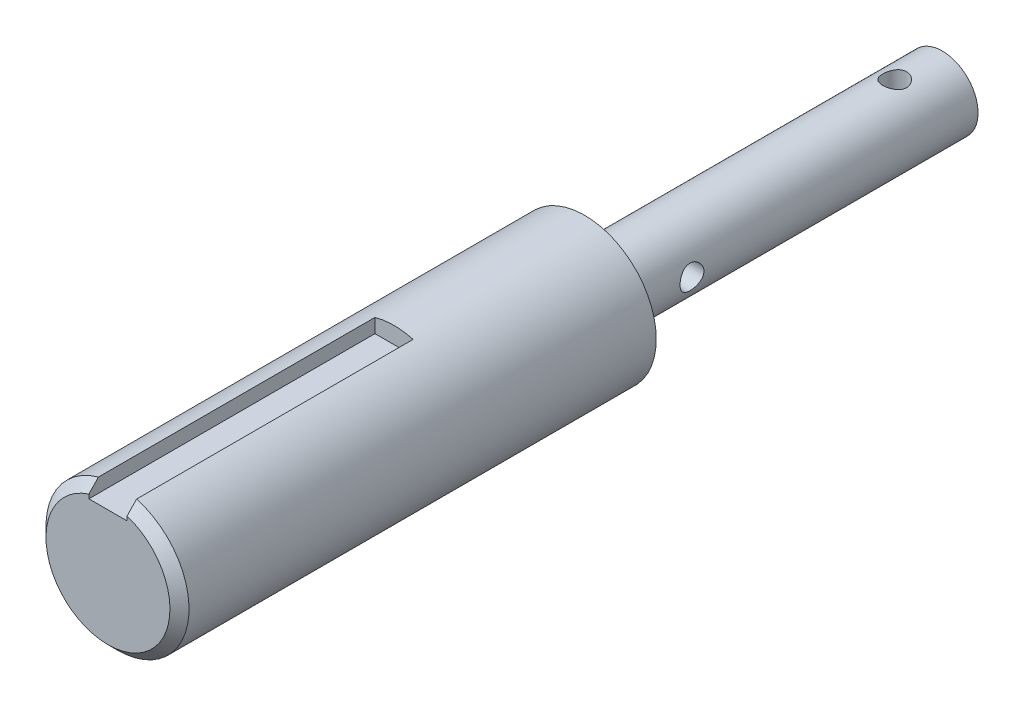
ISO-10303-21;
HEADER;
FILE_DESCRIPTION(('STEP AP214'),'2;1');
FILE_NAME('part.step','',(''),(''),'','','');
FILE_SCHEMA(('AUTOMOTIVE_DESIGN { 1 0 10303 214 1 1 1 1 }'));
ENDSEC;
DATA;
#1=APPLICATION_CONTEXT('core data for automotive mechanical design processes');
#2=APPLICATION_PROTOCOL_DEFINITION('international standard','automotive_design',2000,#1);
#3=PRODUCT_CONTEXT('',#1,'mechanical');
#4=PRODUCT('Part','Part','',(#3));
#5=PRODUCT_RELATED_PRODUCT_CATEGORY('part','',(#4));
#6=PRODUCT_DEFINITION_FORMATION('','',#4);
#7=PRODUCT_DEFINITION_CONTEXT('part definition',#1,'design');
#8=PRODUCT_DEFINITION('design','',#6,#7);
#9=PRODUCT_DEFINITION_SHAPE('','',#8);
#10=(LENGTH_UNIT() NAMED_UNIT(*) SI_UNIT(.MILLI.,.METRE.));
#11=(NAMED_UNIT(*) PLANE_ANGLE_UNIT() SI_UNIT($,.RADIAN.));
#12=(NAMED_UNIT(*) SI_UNIT($,.STERADIAN.) SOLID_ANGLE_UNIT());
#13=UNCERTAINTY_MEASURE_WITH_UNIT(LENGTH_MEASURE(1.E-05),#10,'distance_accuracy_value','');
#14=(GEOMETRIC_REPRESENTATION_CONTEXT(3) GLOBAL_UNCERTAINTY_ASSIGNED_CONTEXT((#13)) GLOBAL_UNIT_ASSIGNED_CONTEXT((#10,
#11,#12)) REPRESENTATION_CONTEXT('',''));
#15=CARTESIAN_POINT('',(0.,0.,0.));
#16=DIRECTION('',(0.,0.,1.));
#17=DIRECTION('',(1.,0.,0.));
#18=AXIS2_PLACEMENT_3D('',#15,#16,#17);
#19=CARTESIAN_POINT('',(1.04083408558608E-13,0.3010475625978,150.579720291741));
#20=DIRECTION('',(0.,0.,-0.999999999999999));
#21=DIRECTION('',(-1.,0.,0.));
#22=AXIS2_PLACEMENT_3D('',#19,#20,#21);
#23=CYLINDRICAL_SURFACE('',#22,30.);
#24=DIRECTION('',(0.,0.,-0.999999999999999));
#25=VECTOR('',#24,1.);
#26=CARTESIAN_POINT('',(8.00000000000008,29.2147121521996,150.579720291741));
#27=LINE('',#26,#25);
#28=CARTESIAN_POINT('',(8.00000000000001,29.2147121521996,30.5797202917406));
#29=VERTEX_POINT('',#28);
#30=CARTESIAN_POINT('',(8.00000000000012,29.2147121521996,146.57972029174));
#31=VERTEX_POINT('',#30);
#32=EDGE_CURVE('E149',#29,#31,#27,.F.);
#33=ORIENTED_EDGE('',*,*,#32,.T.);
#34=CARTESIAN_POINT('',(0.,0.301047562597627,146.579720291741));
#35=DIRECTION('',(0.,0.,0.999999999999999));
#36=DIRECTION('',(1.,0.,0.));
#37=AXIS2_PLACEMENT_3D('',#34,#35,#36);
#38=CIRCLE('',#37,30.);
#39=CARTESIAN_POINT('',(-7.99999999999994,29.2147121521996,146.57972029174));
#40=VERTEX_POINT('',#39);
#41=EDGE_CURVE('E77',#31,#40,#38,.F.);
#42=ORIENTED_EDGE('',*,*,#41,.T.);
#43=DIRECTION('',(0.,0.,-0.999999999999999));
#44=VECTOR('',#43,1.);
#45=CARTESIAN_POINT('',(-7.99999999999993,29.2147121521997,150.579720291741));
#46=LINE('',#45,#44);
#47=CARTESIAN_POINT('',(-7.99999999999999,29.2147121521996,30.5797202917406));
#48=VERTEX_POINT('',#47);
#49=EDGE_CURVE('E153',#40,#48,#46,.T.);
#50=ORIENTED_EDGE('',*,*,#49,.T.);
#51=CARTESIAN_POINT('',(0.,0.301047562597731,30.5797202917406));
#52=DIRECTION('',(0.,0.,-0.999999999999999));
#53=DIRECTION('',(-1.,0.,0.));
#54=AXIS2_PLACEMENT_3D('',#51,#52,#53);
#55=CIRCLE('',#54,30.);
#56=EDGE_CURVE('E117',#48,#29,#55,.T.);
#57=ORIENTED_EDGE('',*,*,#56,.T.);
#58=EDGE_LOOP('',(#33,#42,#50,#57));
#59=FACE_BOUND('',#58,.T.);
#60=CARTESIAN_POINT('',(0.,0.301047562597648,-49.4202797082594));
#61=DIRECTION('',(0.,0.,0.999999999999999));
#62=DIRECTION('',(1.,0.,0.));
#63=AXIS2_PLACEMENT_3D('',#60,#61,#62);
#64=CIRCLE('',#63,30.);
#65=CARTESIAN_POINT('',(30.,0.301047562597631,-49.4202797082594));
#66=VERTEX_POINT('',#65);
#67=EDGE_CURVE('E156',#66,#66,#64,.T.);
#68=ORIENTED_EDGE('',*,*,#67,.T.);
#69=EDGE_LOOP('',(#68));
#70=FACE_BOUND('',#69,.T.);
#71=ADVANCED_FACE('F53',(#59,#70),#23,.T.);
#72=CARTESIAN_POINT('',(1.04083408558608E-13,0.3010475625978,150.579720291741));
#73=DIRECTION('',(0.,0.,0.999999999999999));
#74=DIRECTION('',(1.,0.,0.));
#75=AXIS2_PLACEMENT_3D('',#72,#73,#74);
#76=PLANE('',#75);
#77=DIRECTION('',(0.,-1.,0.));
#78=VECTOR('',#77,1.);
#79=CARTESIAN_POINT('',(-7.99999999999997,0.301047562597745,150.579720291741));
#80=LINE('',#79,#78);
#81=CARTESIAN_POINT('',(-7.9999999999999,25.0396813163037,150.579720291741));
#82=VERTEX_POINT('',#81);
#83=CARTESIAN_POINT('',(-7.99999999999993,23.3010475625978,150.579720291741));
#84=VERTEX_POINT('',#83);
#85=EDGE_CURVE('E126',#82,#84,#80,.T.);
#86=ORIENTED_EDGE('',*,*,#85,.F.);
#87=CARTESIAN_POINT('',(1.04083408558608E-13,0.3010475625978,150.579720291741));
#88=DIRECTION('',(0.,0.,0.999999999999999));
#89=DIRECTION('',(1.,0.,0.));
#90=AXIS2_PLACEMENT_3D('',#87,#88,#89);
#91=CIRCLE('',#90,26.);
#92=CARTESIAN_POINT('',(8.00000000000016,25.0396813163036,150.579720291741));
#93=VERTEX_POINT('',#92);
#94=EDGE_CURVE('E164',#82,#93,#91,.T.);
#95=ORIENTED_EDGE('',*,*,#94,.T.);
#96=DIRECTION('',(0.,1.,0.));
#97=VECTOR('',#96,1.);
#98=CARTESIAN_POINT('',(8.00000000000012,37.3010475625977,150.579720291741));
#99=LINE('',#98,#97);
#100=CARTESIAN_POINT('',(8.00000000000013,23.3010475625977,150.579720291741));
#101=VERTEX_POINT('',#100);
#102=EDGE_CURVE('E120',#101,#93,#99,.T.);
#103=ORIENTED_EDGE('',*,*,#102,.F.);
#104=DIRECTION('',(1.,0.,0.));
#105=VECTOR('',#104,1.);
#106=CARTESIAN_POINT('',(8.00000000000013,23.3010475625977,150.579720291741));
#107=LINE('',#106,#105);
#108=EDGE_CURVE('E142',#84,#101,#107,.T.);
#109=ORIENTED_EDGE('',*,*,#108,.F.);
#110=EDGE_LOOP('',(#86,#95,#103,#109));
#111=FACE_BOUND('',#110,.T.);
#112=ADVANCED_FACE('F186',(#111),#76,.T.);
#113=CARTESIAN_POINT('',(0.,0.301047562597648,-49.4202797082594));
#114=DIRECTION('',(0.,0.,0.999999999999999));
#115=DIRECTION('',(1.,0.,0.));
#116=AXIS2_PLACEMENT_3D('',#113,#114,#115);
#117=PLANE('',#116);
#118=CARTESIAN_POINT('',(0.,0.,-49.4202797082594));
#119=DIRECTION('',(0.,0.,-0.999999999999999));
#120=DIRECTION('',(-1.,0.,0.));
#121=AXIS2_PLACEMENT_3D('',#118,#119,#120);
#122=CIRCLE('',#121,15.);
#123=CARTESIAN_POINT('',(-15.0000000000001,0.,-49.4202797082594));
#124=VERTEX_POINT('',#123);
#125=EDGE_CURVE('E11',#124,#124,#122,.T.);
#126=ORIENTED_EDGE('',*,*,#125,.F.);
#127=EDGE_LOOP('',(#126));
#128=FACE_BOUND('',#127,.T.);
#129=ORIENTED_EDGE('',*,*,#67,.F.);
#130=EDGE_LOOP('',(#129));
#131=FACE_BOUND('',#130,.T.);
#132=ADVANCED_FACE('F228',(#128,#131),#117,.F.);
#133=CARTESIAN_POINT('',(0.,0.301047562597731,30.5797202917406));
#134=DIRECTION('',(0.,0.,-0.999999999999999));
#135=DIRECTION('',(-1.,0.,0.));
#136=AXIS2_PLACEMENT_3D('',#133,#134,#135);
#137=PLANE('',#136);
#138=DIRECTION('',(0.,-1.,0.));
#139=VECTOR('',#138,1.);
#140=CARTESIAN_POINT('',(-7.99999999999999,37.3010475625976,30.5797202917406));
#141=LINE('',#140,#139);
#142=CARTESIAN_POINT('',(-8.,23.3010475625976,30.5797202917407));
#143=VERTEX_POINT('',#142);
#144=EDGE_CURVE('E110',#48,#143,#141,.T.);
#145=ORIENTED_EDGE('',*,*,#144,.T.);
#146=DIRECTION('',(1.,0.,0.));
#147=VECTOR('',#146,1.);
#148=CARTESIAN_POINT('',(8.00000000000008,23.3010475625977,30.5797202917407));
#149=LINE('',#148,#147);
#150=CARTESIAN_POINT('',(8.00000000000008,23.3010475625977,30.5797202917407));
#151=VERTEX_POINT('',#150);
#152=EDGE_CURVE('E115',#143,#151,#149,.T.);
#153=ORIENTED_EDGE('',*,*,#152,.T.);
#154=DIRECTION('',(0.,1.,0.));
#155=VECTOR('',#154,1.);
#156=CARTESIAN_POINT('',(8.00000000000003,37.3010475625977,30.5797202917406));
#157=LINE('',#156,#155);
#158=EDGE_CURVE('E132',#151,#29,#157,.T.);
#159=ORIENTED_EDGE('',*,*,#158,.T.);
#160=ORIENTED_EDGE('',*,*,#56,.F.);
#161=EDGE_LOOP('',(#145,#153,#159,#160));
#162=FACE_BOUND('',#161,.T.);
#163=ADVANCED_FACE('F112',(#162),#137,.F.);
#164=CARTESIAN_POINT('',(-7.99999999999999,37.3010475625976,30.5797202917406));
#165=DIRECTION('',(-1.,0.,0.));
#166=DIRECTION('',(0.,-1.,0.));
#167=AXIS2_PLACEMENT_3D('',#164,#165,#166);
#168=PLANE('',#167);
#169=ORIENTED_EDGE('',*,*,#49,.F.);
#170=CARTESIAN_POINT('',(-7.99999999999994,29.2147121521996,146.57972029174));
#171=CARTESIAN_POINT('',(-8.00000000000002,28.8677823098659,146.914085047153));
#172=CARTESIAN_POINT('',(-8.00000000000004,28.5206408970274,147.248230432547));
#173=CARTESIAN_POINT('',(-8.00000000000006,27.8258836201073,147.916025797138));
#174=CARTESIAN_POINT('',(-8.00000000000005,27.4782677572377,148.249675777595));
#175=CARTESIAN_POINT('',(-8.00000000000005,26.7825083252289,148.916425540629));
#176=CARTESIAN_POINT('',(-8.00000000000006,26.4343647558228,149.249525322926));
#177=CARTESIAN_POINT('',(-8.00000000000004,25.7374841640732,149.915105265119));
#178=CARTESIAN_POINT('',(-8.,25.3887471402176,150.247585423431));
#179=CARTESIAN_POINT('',(-7.9999999999999,25.0396813163037,150.579720291741));
#180=B_SPLINE_CURVE_WITH_KNOTS('',3,(#170,#171,#172,#173,#174,#175,#176,#177,#178,#179),
.UNSPECIFIED.,.F.,.F.,(4,2,2,2,4),(0.,1.44548991723192,2.89097614839767,4.33646311066228,
5.78195376179127),.UNSPECIFIED.);
#181=EDGE_CURVE('E69',#40,#82,#180,.T.);
#182=ORIENTED_EDGE('',*,*,#181,.T.);
#183=ORIENTED_EDGE('',*,*,#85,.T.);
#184=DIRECTION('',(0.,0.,0.999999999999999));
#185=VECTOR('',#184,1.);
#186=CARTESIAN_POINT('',(-8.,23.3010475625976,30.5797202917407));
#187=LINE('',#186,#185);
#188=EDGE_CURVE('E123',#143,#84,#187,.T.);
#189=ORIENTED_EDGE('',*,*,#188,.F.);
#190=ORIENTED_EDGE('',*,*,#144,.F.);
#191=EDGE_LOOP('',(#169,#182,#183,#189,#190));
#192=FACE_BOUND('',#191,.T.);
#193=ADVANCED_FACE('F124',(#192),#168,.F.);
#194=CARTESIAN_POINT('',(8.00000000000003,37.3010475625977,30.5797202917406));
#195=DIRECTION('',(1.,0.,0.));
#196=DIRECTION('',(0.,1.,0.));
#197=AXIS2_PLACEMENT_3D('',#194,#195,#196);
#198=PLANE('',#197);
#199=ORIENTED_EDGE('',*,*,#102,.T.);
#200=CARTESIAN_POINT('',(8.00000000000012,25.0396813163036,150.579720291741));
#201=CARTESIAN_POINT('',(8.00000000000002,25.3887471402175,150.247585423431));
#202=CARTESIAN_POINT('',(7.99999999999997,25.7374841640733,149.915105265119));
#203=CARTESIAN_POINT('',(7.99999999999995,26.4343647558228,149.249525322926));
#204=CARTESIAN_POINT('',(7.99999999999996,26.7825083252289,148.916425540629));
#205=CARTESIAN_POINT('',(7.99999999999996,27.4782677572377,148.249675777595));
#206=CARTESIAN_POINT('',(7.99999999999995,27.8258836201073,147.916025797138));
#207=CARTESIAN_POINT('',(7.99999999999997,28.5206408970274,147.248230432547));
#208=CARTESIAN_POINT('',(8.00000000000001,28.8677823098659,146.914085047153));
#209=CARTESIAN_POINT('',(8.00000000000009,29.2147121521996,146.579720291741));
#210=B_SPLINE_CURVE_WITH_KNOTS('',3,(#200,#201,#202,#203,#204,#205,#206,#207,#208,#209),
.UNSPECIFIED.,.F.,.F.,(4,2,2,2,4),(0.,1.445490651129,2.89097761339361,4.33646384455939,
5.78195376179128),.UNSPECIFIED.);
#211=EDGE_CURVE('E85',#93,#31,#210,.T.);
#212=ORIENTED_EDGE('',*,*,#211,.T.);
#213=ORIENTED_EDGE('',*,*,#32,.F.);
#214=ORIENTED_EDGE('',*,*,#158,.F.);
#215=DIRECTION('',(0.,0.,0.999999999999999));
#216=VECTOR('',#215,1.);
#217=CARTESIAN_POINT('',(8.00000000000008,23.3010475625977,30.5797202917407));
#218=LINE('',#217,#216);
#219=EDGE_CURVE('E131',#151,#101,#218,.T.);
#220=ORIENTED_EDGE('',*,*,#219,.T.);
#221=EDGE_LOOP('',(#199,#212,#213,#214,#220));
#222=FACE_BOUND('',#221,.T.);
#223=ADVANCED_FACE('F176',(#222),#198,.F.);
#224=CARTESIAN_POINT('',(8.00000000000008,23.3010475625977,30.5797202917407));
#225=DIRECTION('',(0.,-1.,0.));
#226=DIRECTION('',(0.,0.,-0.999999999999999));
#227=AXIS2_PLACEMENT_3D('',#224,#225,#226);
#228=PLANE('',#227);
#229=ORIENTED_EDGE('',*,*,#108,.T.);
#230=ORIENTED_EDGE('',*,*,#219,.F.);
#231=ORIENTED_EDGE('',*,*,#152,.F.);
#232=ORIENTED_EDGE('',*,*,#188,.T.);
#233=EDGE_LOOP('',(#229,#230,#231,#232));
#234=FACE_BOUND('',#233,.T.);
#235=ADVANCED_FACE('F134',(#234),#228,.F.);
#236=CARTESIAN_POINT('',(1.04083408558608E-13,0.3010475625978,150.579720291741));
#237=DIRECTION('',(0.,0.,-0.999999999999999));
#238=DIRECTION('',(-1.,0.,0.));
#239=AXIS2_PLACEMENT_3D('',#236,#237,#238);
#240=CONICAL_SURFACE('',#239,26.,0.785398163397445);
#241=ORIENTED_EDGE('',*,*,#181,.F.);
#242=ORIENTED_EDGE('',*,*,#41,.F.);
#243=ORIENTED_EDGE('',*,*,#211,.F.);
#244=ORIENTED_EDGE('',*,*,#94,.F.);
#245=EDGE_LOOP('',(#241,#242,#243,#244));
#246=FACE_BOUND('',#245,.T.);
#247=ADVANCED_FACE('F55',(#246),#240,.T.);
#248=CARTESIAN_POINT('',(-1.04083408558608E-13,-3.60822483003176E-13,-199.420279708259));
#249=DIRECTION('',(0.,0.,0.999999999999999));
#250=DIRECTION('',(1.,0.,0.));
#251=AXIS2_PLACEMENT_3D('',#248,#249,#250);
#252=CYLINDRICAL_SURFACE('',#251,15.);
#253=CARTESIAN_POINT('',(15.,-1.80411241501588E-13,-84.4202797082594));
#254=CARTESIAN_POINT('',(15.0000007650471,-0.272816814433762,-84.4202809769176));
#255=CARTESIAN_POINT('',(14.9924884753768,-0.545625972692841,-84.3978783776234));
#256=CARTESIAN_POINT('',(14.9632605101644,-1.08320880436495,-84.3091341641733));
#257=CARTESIAN_POINT('',(14.941543360109,-1.34798164059423,-84.2427879885146));
#258=CARTESIAN_POINT('',(14.8862653953208,-1.86166394750878,-84.0686834913393));
#259=CARTESIAN_POINT('',(14.8527243865376,-2.11059912942978,-83.9609943959637));
#260=CARTESIAN_POINT('',(14.7772222858721,-2.58687468402705,-83.7075738440671));
#261=CARTESIAN_POINT('',(14.7352595334077,-2.81421078479506,-83.5618348832443));
#262=CARTESIAN_POINT('',(14.645704722131,-3.24870837510974,-83.2311506839678));
#263=CARTESIAN_POINT('',(14.5979778231162,-3.45501850148556,-83.0451235369651));
#264=CARTESIAN_POINT('',(14.5030157392292,-3.83416346351653,-82.6414439347184));
#265=CARTESIAN_POINT('',(14.4557806648007,-4.00699092746993,-82.4237845335863));
#266=CARTESIAN_POINT('',(14.3656666235818,-4.31912471111906,-81.9553541323043));
#267=CARTESIAN_POINT('',(14.3229519627198,-4.45732429102257,-81.7038110097086));
#268=CARTESIAN_POINT('',(14.2487652698845,-4.68909436930569,-81.1793992360805));
#269=CARTESIAN_POINT('',(14.2172898077929,-4.78267848691267,-80.9065371224808));
#270=CARTESIAN_POINT('',(14.1705651637057,-4.91936730756504,-80.3569136007481));
#271=CARTESIAN_POINT('',(14.1548047884339,-4.96406724136042,-80.0805936657996));
#272=CARTESIAN_POINT('',(14.139782831522,-5.00670561667096,-79.5239609374944));
#273=CARTESIAN_POINT('',(14.1405161515597,-5.00465850803682,-79.2436494047434));
#274=CARTESIAN_POINT('',(14.1579507500053,-4.95509951850377,-78.7005965559982));
#275=CARTESIAN_POINT('',(14.1739207918415,-4.90966956578094,-78.4376376935409));
#276=CARTESIAN_POINT('',(14.2188328846856,-4.77803081419376,-77.9233126101089));
#277=CARTESIAN_POINT('',(14.2477764887883,-4.69181713294767,-77.6719477810571));
#278=CARTESIAN_POINT('',(14.3158955569847,-4.479695290318,-77.1832159603397));
#279=CARTESIAN_POINT('',(14.3552282897692,-4.35317024354092,-76.946139580922));
#280=CARTESIAN_POINT('',(14.4396279286729,-4.06444553151137,-76.4959251668508));
#281=CARTESIAN_POINT('',(14.4846964894921,-3.90223556181912,-76.2827940735897));
#282=CARTESIAN_POINT('',(14.5783664584198,-3.53674666341281,-75.8748217174584));
#283=CARTESIAN_POINT('',(14.6270294677509,-3.33176575038206,-75.681516235715));
#284=CARTESIAN_POINT('',(14.7203469193431,-2.89169784985008,-75.3316233749416));
#285=CARTESIAN_POINT('',(14.7650009769011,-2.65660797830422,-75.1750395174365));
#286=CARTESIAN_POINT('',(14.8458553968921,-2.1597380652317,-74.9017982070841));
#287=CARTESIAN_POINT('',(14.8819675004026,-1.89771638208187,-74.7855522515558));
#288=CARTESIAN_POINT('',(14.9410283572211,-1.35634541682265,-74.5992638384808));
#289=CARTESIAN_POINT('',(14.9639816827439,-1.07700219077497,-74.529205331142));
#290=CARTESIAN_POINT('',(14.9933813535722,-0.521919147646797,-74.4400013781474));
#291=CARTESIAN_POINT('',(15.0005000916864,-0.246547999324487,-74.4187806623957));
#292=CARTESIAN_POINT('',(14.9994451347413,0.303875349800955,-74.4219430762518));
#293=CARTESIAN_POINT('',(14.9912740209681,0.578927596598024,-74.4463185081586));
#294=CARTESIAN_POINT('',(14.9610012358553,1.11259933152106,-74.538339246939));
#295=CARTESIAN_POINT('',(14.9393099355596,1.37146403417401,-74.6047107385068));
#296=CARTESIAN_POINT('',(14.8845923415034,1.87427979289774,-74.7772469305931));
#297=CARTESIAN_POINT('',(14.8515646023338,2.11822894254297,-74.8834167055983));
#298=CARTESIAN_POINT('',(14.7764465643645,2.59144148196634,-75.1356318674633));
#299=CARTESIAN_POINT('',(14.7341407377892,2.82014979608568,-75.2826526746753));
#300=CARTESIAN_POINT('',(14.645262695813,3.25032415067789,-75.6112504583268));
#301=CARTESIAN_POINT('',(14.5986891796914,3.45178183897788,-75.7928379884182));
#302=CARTESIAN_POINT('',(14.5038423990222,3.83126253903148,-76.1951734632923));
#303=CARTESIAN_POINT('',(14.4555880543713,4.00780484622878,-76.4173258428937));
#304=CARTESIAN_POINT('',(14.3649986647353,4.32128761161778,-76.8891375473138));
#305=CARTESIAN_POINT('',(14.3226636691001,4.45822773965501,-77.1387971014297));
#306=CARTESIAN_POINT('',(14.2491195895692,4.68798465208178,-77.6586447847088));
#307=CARTESIAN_POINT('',(14.2178880396488,4.78089066082507,-77.9287901041031));
#308=CARTESIAN_POINT('',(14.1705416153224,4.91947333379661,-78.4821729584799));
#309=CARTESIAN_POINT('',(14.154419931182,4.9651712747694,-78.765404535281));
#310=CARTESIAN_POINT('',(14.1398929437088,5.00638141238645,-79.3212651884639));
#311=CARTESIAN_POINT('',(14.1406200128706,5.00435128654189,-79.5936914096935));
#312=CARTESIAN_POINT('',(14.1575634911932,4.95621146724346,-80.1341050828697));
#313=CARTESIAN_POINT('',(14.1737789784681,4.91010439729287,-80.4020927980349));
#314=CARTESIAN_POINT('',(14.2192262152446,4.77685906564665,-80.9209580232718));
#315=CARTESIAN_POINT('',(14.2482049011238,4.69051673007751,-81.1720638332819));
#316=CARTESIAN_POINT('',(14.3158199409233,4.47989682879866,-81.6564167429508));
#317=CARTESIAN_POINT('',(14.3544584381696,4.3556108427689,-81.8896598641994));
#318=CARTESIAN_POINT('',(14.4391414613023,4.06630346291704,-82.3426980578739));
#319=CARTESIAN_POINT('',(14.4854355821068,3.89974121382286,-82.5614622177514));
#320=CARTESIAN_POINT('',(14.5791678141625,3.53321441567814,-82.9687287751804));
#321=CARTESIAN_POINT('',(14.6266062456185,3.33324042225718,-83.1572225866996));
#322=CARTESIAN_POINT('',(14.7195015262771,2.89620778460321,-83.5060017697051));
#323=CARTESIAN_POINT('',(14.7648090900627,2.65800756749855,-83.6649014470144));
#324=CARTESIAN_POINT('',(14.8462995586305,2.15678678703311,-83.9402318525127));
#325=CARTESIAN_POINT('',(14.8824847953965,1.89377259066169,-84.0566734378695));
#326=CARTESIAN_POINT('',(14.9402757534271,1.36246823600479,-84.2388878707026));
#327=CARTESIAN_POINT('',(14.9624606211261,1.09493878838196,-84.3066920395763));
#328=CARTESIAN_POINT('',(14.9923203532111,0.55160208005112,-84.3973811116451));
#329=CARTESIAN_POINT('',(14.9999992265953,0.275797127843574,-84.4202784257421));
#330=CARTESIAN_POINT('',(15.,-1.80411241501588E-13,-84.4202797082594));
#331=B_SPLINE_CURVE_WITH_KNOTS('',3,(#253,#254,#255,#256,#257,#258,#259,#260,#261,#262,#263,
#264,#265,#266,#267,#268,#269,#270,#271,#272,#273,#274,#275,#276,#277,#278,#279,#280,#281,#282,
#283,#284,#285,#286,#287,#288,#289,#290,#291,#292,#293,#294,#295,#296,#297,#298,#299,#300,#301,
#302,#303,#304,#305,#306,#307,#308,#309,#310,#311,#312,#313,#314,#315,#316,#317,#318,#319,#320,
#321,#322,#323,#324,#325,#326,#327,#328,#329,#330),.UNSPECIFIED.,.T.,.F.,(4,2,2,2,2,2,2,2,2,2,2,
2,2,2,2,2,2,2,2,2,2,2,2,2,2,2,2,2,2,2,2,2,2,2,2,2,2,2,4),(0.,0.817435530129967,1.63495592633743,
2.4511133643512,3.26743188899533,4.10923421413766,4.9512216643764,5.81741924118912,
6.68335223467743,7.52009628712778,8.35658169941005,9.15484132763703,9.95319654288045,
10.7644085578629,11.5758551280167,12.4296652906748,13.2835572984374,14.1459202826243,
15.0079834439668,15.8326791588649,16.6572356583152,17.4579078990172,18.2586822643118,
19.0805199922935,19.9026090412012,20.7620511441442,21.6215004118564,22.479200691445,
23.3365142353985,24.1497833033195,24.9630039676754,25.7607793541275,26.5587319089055,
27.3915033346969,28.2245105562956,29.0899830418616,29.9552340577293,30.7818279187973,
31.6081933020137),.UNSPECIFIED.);
#332=CARTESIAN_POINT('',(15.,-1.80411241501588E-13,-84.4202797082594));
#333=VERTEX_POINT('',#332);
#334=EDGE_CURVE('E58',#333,#333,#331,.T.);
#335=ORIENTED_EDGE('',*,*,#334,.T.);
#336=EDGE_LOOP('',(#335));
#337=FACE_BOUND('',#336,.T.);
#338=CARTESIAN_POINT('',(-15.0000000000001,-2.08166817117217E-13,-84.4202797082593));
#339=CARTESIAN_POINT('',(-15.0000007650472,0.27281681443342,-84.4202809769176));
#340=CARTESIAN_POINT('',(-14.9924884753769,0.545625972692552,-84.3978783776234));
#341=CARTESIAN_POINT('',(-14.9632605101644,1.08320880436476,-84.3091341641733));
#342=CARTESIAN_POINT('',(-14.941543360109,1.34798164059408,-84.2427879885147));
#343=CARTESIAN_POINT('',(-14.8862653953208,1.86166394750869,-84.0686834913393));
#344=CARTESIAN_POINT('',(-14.8527243865376,2.1105991294297,-83.9609943959636));
#345=CARTESIAN_POINT('',(-14.7772222858721,2.58687468402702,-83.7075738440671));
#346=CARTESIAN_POINT('',(-14.7352595334076,2.81421078479507,-83.5618348832443));
#347=CARTESIAN_POINT('',(-14.6457047221309,3.24870837510976,-83.2311506839678));
#348=CARTESIAN_POINT('',(-14.5979778231161,3.45501850148555,-83.0451235369651));
#349=CARTESIAN_POINT('',(-14.5030157392292,3.8341634635164,-82.6414439347184));
#350=CARTESIAN_POINT('',(-14.4557806648007,4.00699092746969,-82.4237845335862));
#351=CARTESIAN_POINT('',(-14.3656666235819,4.31912471111886,-81.9553541323042));
#352=CARTESIAN_POINT('',(-14.3229519627198,4.45732429102252,-81.7038110097086));
#353=CARTESIAN_POINT('',(-14.2487652698844,4.68909436930551,-81.1793992360805));
#354=CARTESIAN_POINT('',(-14.217289807793,4.78267848691221,-80.9065371224808));
#355=CARTESIAN_POINT('',(-14.1705651637057,4.91936730756462,-80.356913600748));
#356=CARTESIAN_POINT('',(-14.1548047884338,4.96406724136029,-80.0805936657996));
#357=CARTESIAN_POINT('',(-14.139782831522,5.00670561667087,-79.5239609374943));
#358=CARTESIAN_POINT('',(-14.1405161515599,5.00465850803648,-79.2436494047434));
#359=CARTESIAN_POINT('',(-14.1579507500054,4.9550995185034,-78.7005965559981));
#360=CARTESIAN_POINT('',(-14.1739207918415,4.90966956578077,-78.4376376935407));
#361=CARTESIAN_POINT('',(-14.2188328846856,4.77803081419364,-77.9233126101088));
#362=CARTESIAN_POINT('',(-14.2477764887884,4.69181713294738,-77.6719477810571));
#363=CARTESIAN_POINT('',(-14.3158955569848,4.47969529031767,-77.1832159603397));
#364=CARTESIAN_POINT('',(-14.3552282897692,4.35317024354073,-76.9461395809219));
#365=CARTESIAN_POINT('',(-14.4396279286729,4.06444553151119,-76.4959251668507));
#366=CARTESIAN_POINT('',(-14.4846964894921,3.9022355618188,-76.2827940735897));
#367=CARTESIAN_POINT('',(-14.5783664584198,3.53674666341246,-75.8748217174584));
#368=CARTESIAN_POINT('',(-14.6270294677509,3.33176575038182,-75.6815162357149));
#369=CARTESIAN_POINT('',(-14.7203469193431,2.89169784984987,-75.3316233749416));
#370=CARTESIAN_POINT('',(-14.7650009769011,2.65660797830392,-75.1750395174366));
#371=CARTESIAN_POINT('',(-14.8458553968921,2.15973806523138,-74.9017982070841));
#372=CARTESIAN_POINT('',(-14.8819675004026,1.89771638208163,-74.7855522515558));
#373=CARTESIAN_POINT('',(-14.9410283572211,1.35634541682243,-74.5992638384808));
#374=CARTESIAN_POINT('',(-14.9639816827438,1.07700219077469,-74.5292053311422));
#375=CARTESIAN_POINT('',(-14.9933813535722,0.521919147646435,-74.4400013781477));
#376=CARTESIAN_POINT('',(-15.0005000916865,0.246547999324109,-74.4187806623957));
#377=CARTESIAN_POINT('',(-14.9994451347414,-0.303875349801385,-74.4219430762517));
#378=CARTESIAN_POINT('',(-14.9912740209682,-0.578927596598489,-74.4463185081587));
#379=CARTESIAN_POINT('',(-14.9610012358554,-1.11259933152149,-74.5383392469392));
#380=CARTESIAN_POINT('',(-14.9393099355597,-1.37146403417438,-74.6047107385069));
#381=CARTESIAN_POINT('',(-14.8845923415035,-1.874279792898,-74.7772469305931));
#382=CARTESIAN_POINT('',(-14.8515646023338,-2.11822894254319,-74.8834167055983));
#383=CARTESIAN_POINT('',(-14.7764465643645,-2.59144148196649,-75.1356318674633));
#384=CARTESIAN_POINT('',(-14.7341407377894,-2.82014979608579,-75.2826526746753));
#385=CARTESIAN_POINT('',(-14.6452626958132,-3.25032415067804,-75.6112504583268));
#386=CARTESIAN_POINT('',(-14.5986891796914,-3.45178183897811,-75.7928379884181));
#387=CARTESIAN_POINT('',(-14.5038423990223,-3.8312625390317,-76.1951734632922));
#388=CARTESIAN_POINT('',(-14.4555880543715,-4.0078048462289,-76.4173258428937));
#389=CARTESIAN_POINT('',(-14.3649986647355,-4.32128761161794,-76.8891375473139));
#390=CARTESIAN_POINT('',(-14.3226636691001,-4.4582277396553,-77.1387971014297));
#391=CARTESIAN_POINT('',(-14.2491195895692,-4.68798465208203,-77.6586447847088));
#392=CARTESIAN_POINT('',(-14.2178880396491,-4.78089066082515,-77.9287901041032));
#393=CARTESIAN_POINT('',(-14.1705416153226,-4.91947333379684,-78.4821729584801));
#394=CARTESIAN_POINT('',(-14.1544199311819,-4.96517127476996,-78.7654045352811));
#395=CARTESIAN_POINT('',(-14.1398929437088,-5.00638141238697,-79.321265188464));
#396=CARTESIAN_POINT('',(-14.1406200128709,-5.00435128654207,-79.5936914096935));
#397=CARTESIAN_POINT('',(-14.1575634911935,-4.9562114672435,-80.1341050828698));
#398=CARTESIAN_POINT('',(-14.1737789784681,-4.91010439729312,-80.4020927980349));
#399=CARTESIAN_POINT('',(-14.2192262152446,-4.77685906564695,-80.9209580232719));
#400=CARTESIAN_POINT('',(-14.248204901124,-4.69051673007767,-81.1720638332819));
#401=CARTESIAN_POINT('',(-14.3158199409235,-4.47989682879878,-81.6564167429507));
#402=CARTESIAN_POINT('',(-14.3544584381697,-4.35561084276913,-81.8896598641994));
#403=CARTESIAN_POINT('',(-14.4391414613023,-4.06630346291729,-82.3426980578739));
#404=CARTESIAN_POINT('',(-14.4854355821069,-3.89974121382302,-82.5614622177512));
#405=CARTESIAN_POINT('',(-14.5791678141627,-3.53321441567843,-82.9687287751803));
#406=CARTESIAN_POINT('',(-14.6266062456186,-3.33324042225769,-83.1572225866998));
#407=CARTESIAN_POINT('',(-14.7195015262772,-2.89620778460376,-83.5060017697053));
#408=CARTESIAN_POINT('',(-14.7648090900629,-2.65800756749888,-83.6649014470144));
#409=CARTESIAN_POINT('',(-14.8462995586307,-2.15678678703325,-83.9402318525126));
#410=CARTESIAN_POINT('',(-14.8824847953965,-1.89377259066184,-84.0566734378695));
#411=CARTESIAN_POINT('',(-14.9402757534271,-1.36246823600497,-84.2388878707027));
#412=CARTESIAN_POINT('',(-14.9624606211261,-1.09493878838216,-84.3066920395763));
#413=CARTESIAN_POINT('',(-14.9923203532112,-0.551602080051402,-84.397381111645));
#414=CARTESIAN_POINT('',(-14.9999992265954,-0.275797127843912,-84.420278425742));
#415=CARTESIAN_POINT('',(-15.0000000000001,-2.08166817117217E-13,-84.4202797082593));
#416=B_SPLINE_CURVE_WITH_KNOTS('',3,(#338,#339,#340,#341,#342,#343,#344,#345,#346,#347,#348,
#349,#350,#351,#352,#353,#354,#355,#356,#357,#358,#359,#360,#361,#362,#363,#364,#365,#366,#367,
#368,#369,#370,#371,#372,#373,#374,#375,#376,#377,#378,#379,#380,#381,#382,#383,#384,#385,#386,
#387,#388,#389,#390,#391,#392,#393,#394,#395,#396,#397,#398,#399,#400,#401,#402,#403,#404,#405,
#406,#407,#408,#409,#410,#411,#412,#413,#414,#415),.UNSPECIFIED.,.T.,.F.,(4,2,2,2,2,2,2,2,2,2,2,
2,2,2,2,2,2,2,2,2,2,2,2,2,2,2,2,2,2,2,2,2,2,2,2,2,2,2,4),(0.,0.817435530130102,1.6349559263377,
2.45111336435154,3.26743188899573,4.10923421413801,4.9512216643767,5.81741924118937,
6.68335223467764,7.52009628712804,8.35658169941037,9.1548413276373,9.95319654288069,
10.7644085578631,11.5758551280169,12.429665290675,13.2835572984376,14.1459202826245,
15.007983443967,15.8326791588652,16.6572356583156,17.4579078990174,18.2586822643119,
19.0805199922935,19.9026090412012,20.7620511441443,21.6215004118565,22.4792006914452,
23.3365142353987,24.1497833033197,24.9630039676756,25.7607793541276,26.5587319089056,
27.3915033346969,28.2245105562955,29.0899830418617,29.9552340577296,30.7818279187974,
31.6081933020136),.UNSPECIFIED.);
#417=CARTESIAN_POINT('',(-15.0000000000001,-2.08166817117217E-13,-84.4202797082593));
#418=VERTEX_POINT('',#417);
#419=EDGE_CURVE('E294',#418,#418,#416,.T.);
#420=ORIENTED_EDGE('',*,*,#419,.T.);
#421=EDGE_LOOP('',(#420));
#422=FACE_BOUND('',#421,.T.);
#423=CARTESIAN_POINT('',(0.,-15.,-174.420279708259));
#424=CARTESIAN_POINT('',(0.272816814433585,-15.0000007650471,-174.420278439601));
#425=CARTESIAN_POINT('',(0.5456259726927,-14.9924884753772,-174.442681038895));
#426=CARTESIAN_POINT('',(1.08320880436487,-14.9632605101648,-174.531425252345));
#427=CARTESIAN_POINT('',(1.34798164059418,-14.9415433601092,-174.597771428004));
#428=CARTESIAN_POINT('',(1.86166394750875,-14.8862653953209,-174.771875925179));
#429=CARTESIAN_POINT('',(2.11059912942973,-14.852724386538,-174.879565020555));
#430=CARTESIAN_POINT('',(2.58687468402702,-14.7772222858725,-175.132985572452));
#431=CARTESIAN_POINT('',(2.81421078479507,-14.7352595334079,-175.278724533274));
#432=CARTESIAN_POINT('',(3.24870837510972,-14.6457047221312,-175.609408732551));
#433=CARTESIAN_POINT('',(3.45501850148547,-14.5979778231165,-175.795435879554));
#434=CARTESIAN_POINT('',(3.83416346351636,-14.5030157392295,-176.1991154818));
#435=CARTESIAN_POINT('',(4.00699092746974,-14.4557806648007,-176.416774882932));
#436=CARTESIAN_POINT('',(4.31912471111888,-14.3656666235819,-176.885205284214));
#437=CARTESIAN_POINT('',(4.45732429102241,-14.3229519627201,-177.13674840681));
#438=CARTESIAN_POINT('',(4.68909436930544,-14.2487652698848,-177.661160180438));
#439=CARTESIAN_POINT('',(4.7826784869123,-14.2172898077932,-177.934022294038));
#440=CARTESIAN_POINT('',(4.91936730756469,-14.1705651637059,-178.483645815771));
#441=CARTESIAN_POINT('',(4.96406724136018,-14.1548047884342,-178.759965750719));
#442=CARTESIAN_POINT('',(5.00670561667083,-14.1397828315225,-179.316598479024));
#443=CARTESIAN_POINT('',(5.00465850803667,-14.1405161515602,-179.596910011775));
#444=CARTESIAN_POINT('',(4.9550995185036,-14.1579507500058,-180.139962860521));
#445=CARTESIAN_POINT('',(4.90966956578077,-14.1739207918419,-180.402921722978));
#446=CARTESIAN_POINT('',(4.77803081419351,-14.2188328846859,-180.91724680641));
#447=CARTESIAN_POINT('',(4.69181713294734,-14.2477764887887,-181.168611635462));
#448=CARTESIAN_POINT('',(4.47969529031766,-14.3158955569851,-181.657343456179));
#449=CARTESIAN_POINT('',(4.35317024354065,-14.3552282897696,-181.894419835597));
#450=CARTESIAN_POINT('',(4.06444553151106,-14.4396279286733,-182.344634249668));
#451=CARTESIAN_POINT('',(3.90223556181868,-14.4846964894925,-182.557765342929));
#452=CARTESIAN_POINT('',(3.53674666341239,-14.5783664584202,-182.96573769906));
#453=CARTESIAN_POINT('',(3.33176575038181,-14.6270294677513,-183.159043180804));
#454=CARTESIAN_POINT('',(2.8916978498499,-14.7203469193434,-183.508936041577));
#455=CARTESIAN_POINT('',(2.65660797830395,-14.7650009769013,-183.665519899082));
#456=CARTESIAN_POINT('',(2.15973806523141,-14.8458553968923,-183.938761209434));
#457=CARTESIAN_POINT('',(1.89771638208164,-14.881967500403,-184.055007164963));
#458=CARTESIAN_POINT('',(1.3563454168224,-14.9410283572214,-184.241295578038));
#459=CARTESIAN_POINT('',(1.07700219077464,-14.963981682744,-184.311354085377));
#460=CARTESIAN_POINT('',(0.521919147646412,-14.9933813535724,-184.400558038371));
#461=CARTESIAN_POINT('',(0.246547999324133,-15.0005000916868,-184.421778754123));
#462=CARTESIAN_POINT('',(-0.303875349801245,-14.9994451347417,-184.418616340267));
#463=CARTESIAN_POINT('',(-0.578927596598281,-14.9912740209683,-184.39424090836));
#464=CARTESIAN_POINT('',(-1.11259933152128,-14.9610012358555,-184.30222016958));
#465=CARTESIAN_POINT('',(-1.37146403417423,-14.93930993556,-184.235848678012));
#466=CARTESIAN_POINT('',(-1.87427979289784,-14.8845923415038,-184.063312485926));
#467=CARTESIAN_POINT('',(-2.11822894254296,-14.8515646023338,-183.95714271092));
#468=CARTESIAN_POINT('',(-2.59144148196631,-14.7764465643646,-183.704927549055));
#469=CARTESIAN_POINT('',(-2.82014979608575,-14.7341407377896,-183.557906741844));
#470=CARTESIAN_POINT('',(-3.25032415067801,-14.6452626958135,-183.229308958192));
#471=CARTESIAN_POINT('',(-3.45178183897796,-14.5986891796916,-183.047721428101));
#472=CARTESIAN_POINT('',(-3.83126253903156,-14.5038423990224,-182.645385953226));
#473=CARTESIAN_POINT('',(-4.00780484622892,-14.4555880543717,-182.423233573625));
#474=CARTESIAN_POINT('',(-4.32128761161792,-14.3649986647358,-181.951421869205));
#475=CARTESIAN_POINT('',(-4.4582277396551,-14.3226636691004,-181.701762315089));
#476=CARTESIAN_POINT('',(-4.68798465208187,-14.2491195895694,-181.18191463181));
#477=CARTESIAN_POINT('',(-4.78089066082521,-14.2178880396493,-180.911769312416));
#478=CARTESIAN_POINT('',(-4.91947333379684,-14.1705416153228,-180.358386458039));
#479=CARTESIAN_POINT('',(-4.96517127476967,-14.154419931182,-180.075154881238));
#480=CARTESIAN_POINT('',(-5.00638141238672,-14.1398929437089,-179.519294228055));
#481=CARTESIAN_POINT('',(-5.00435128654211,-14.1406200128711,-179.246868006825));
#482=CARTESIAN_POINT('',(-4.95621146724361,-14.1575634911937,-178.706454333649));
#483=CARTESIAN_POINT('',(-4.91010439729301,-14.1737789784681,-178.438466618484));
#484=CARTESIAN_POINT('',(-4.77685906564682,-14.2192262152446,-177.919601393247));
#485=CARTESIAN_POINT('',(-4.69051673007774,-14.2482049011242,-177.668495583237));
#486=CARTESIAN_POINT('',(-4.47989682879886,-14.3158199409238,-177.184142673568));
#487=CARTESIAN_POINT('',(-4.35561084276905,-14.3544584381697,-176.950899552319));
#488=CARTESIAN_POINT('',(-4.06630346291716,-14.4391414613023,-176.497861358645));
#489=CARTESIAN_POINT('',(-3.89974121382304,-14.4854355821071,-176.279097198767));
#490=CARTESIAN_POINT('',(-3.53321441567837,-14.579167814163,-175.871830641338));
#491=CARTESIAN_POINT('',(-3.3332404222574,-14.6266062456189,-175.683336829819));
#492=CARTESIAN_POINT('',(-2.8962077846034,-14.7195015262775,-175.334557646814));
#493=CARTESIAN_POINT('',(-2.6580075674987,-14.7648090900632,-175.175657969504));
#494=CARTESIAN_POINT('',(-2.1567867870332,-14.8462995586309,-174.900327564006));
#495=CARTESIAN_POINT('',(-1.89377259066173,-14.8824847953967,-174.783885978649));
#496=CARTESIAN_POINT('',(-1.36246823600483,-14.9402757534273,-174.601671545816));
#497=CARTESIAN_POINT('',(-1.09493878838205,-14.9624606211265,-174.533867376942));
#498=CARTESIAN_POINT('',(-0.551602080051277,-14.9923203532114,-174.443178304874));
#499=CARTESIAN_POINT('',(-0.27579712784376,-14.9999992265954,-174.420280990777));
#500=CARTESIAN_POINT('',(0.,-15.,-174.420279708259));
#501=B_SPLINE_CURVE_WITH_KNOTS('',3,(#423,#424,#425,#426,#427,#428,#429,#430,#431,#432,#433,
#434,#435,#436,#437,#438,#439,#440,#441,#442,#443,#444,#445,#446,#447,#448,#449,#450,#451,#452,
#453,#454,#455,#456,#457,#458,#459,#460,#461,#462,#463,#464,#465,#466,#467,#468,#469,#470,#471,
#472,#473,#474,#475,#476,#477,#478,#479,#480,#481,#482,#483,#484,#485,#486,#487,#488,#489,#490,
#491,#492,#493,#494,#495,#496,#497,#498,#499,#500),.UNSPECIFIED.,.T.,.F.,(4,2,2,2,2,2,2,2,2,2,2,
2,2,2,2,2,2,2,2,2,2,2,2,2,2,2,2,2,2,2,2,2,2,2,2,2,2,2,4),(0.,0.817435530130063,1.63495592633763,
2.45111336435138,3.2674318889955,4.10923421413779,4.95122166437647,5.81741924118912,
6.68335223467736,7.52009628712775,8.35658169941011,9.15484132763718,9.95319654288066,
10.7644085578631,11.5758551280169,12.4296652906748,13.2835572984373,14.1459202826243,
15.0079834439669,15.8326791588649,16.6572356583152,17.457907899017,18.2586822643116,
19.0805199922932,19.902609041201,20.762051144144,21.6215004118562,22.4792006914449,
23.3365142353983,24.1497833033192,24.9630039676751,25.7607793541273,26.5587319089053,
27.3915033346967,28.2245105562954,29.0899830418615,29.9552340577294,30.7818279187972,
31.6081933020135),.UNSPECIFIED.);
#502=CARTESIAN_POINT('',(0.,-15.,-174.420279708259));
#503=VERTEX_POINT('',#502);
#504=EDGE_CURVE('E202',#503,#503,#501,.T.);
#505=ORIENTED_EDGE('',*,*,#504,.T.);
#506=EDGE_LOOP('',(#505));
#507=FACE_BOUND('',#506,.T.);
#508=CARTESIAN_POINT('',(0.,15.,-174.420279708259));
#509=CARTESIAN_POINT('',(-0.272816814433622,15.0000007650471,-174.420278439601));
#510=CARTESIAN_POINT('',(-0.545625972692729,14.9924884753766,-174.442681038895));
#511=CARTESIAN_POINT('',(-1.08320880436489,14.963260510164,-174.531425252345));
#512=CARTESIAN_POINT('',(-1.3479816405942,14.9415433601089,-174.597771428004));
#513=CARTESIAN_POINT('',(-1.86166394750878,14.8862653953207,-174.771875925179));
#514=CARTESIAN_POINT('',(-2.11059912942978,14.8527243865373,-174.879565020555));
#515=CARTESIAN_POINT('',(-2.58687468402706,14.7772222858718,-175.132985572452));
#516=CARTESIAN_POINT('',(-2.81421078479508,14.7352595334075,-175.278724533274));
#517=CARTESIAN_POINT('',(-3.24870837510979,14.6457047221308,-175.609408732551));
#518=CARTESIAN_POINT('',(-3.45501850148562,14.5979778231158,-175.795435879554));
#519=CARTESIAN_POINT('',(-3.83416346351651,14.5030157392289,-176.1991154818));
#520=CARTESIAN_POINT('',(-4.00699092746981,14.4557806648006,-176.416774882933));
#521=CARTESIAN_POINT('',(-4.319124711119,14.3656666235818,-176.885205284215));
#522=CARTESIAN_POINT('',(-4.45732429102266,14.3229519627195,-177.13674840681));
#523=CARTESIAN_POINT('',(-4.6890943693057,14.248765269884,-177.661160180438));
#524=CARTESIAN_POINT('',(-4.78267848691245,14.2172898077926,-177.934022294038));
#525=CARTESIAN_POINT('',(-4.91936730756487,14.1705651637054,-178.483645815771));
#526=CARTESIAN_POINT('',(-4.96406724136049,14.1548047884334,-178.759965750719));
#527=CARTESIAN_POINT('',(-5.00670561667101,14.1397828315218,-179.316598479024));
#528=CARTESIAN_POINT('',(-5.0046585080366,14.1405161515599,-179.596910011775));
#529=CARTESIAN_POINT('',(-4.95509951850354,14.1579507500054,-180.139962860521));
#530=CARTESIAN_POINT('',(-4.90966956578094,14.1739207918412,-180.402921722978));
#531=CARTESIAN_POINT('',(-4.77803081419377,14.2188328846852,-180.91724680641));
#532=CARTESIAN_POINT('',(-4.69181713294745,14.2477764887883,-181.168611635462));
#533=CARTESIAN_POINT('',(-4.47969529031771,14.3158955569848,-181.657343456179));
#534=CARTESIAN_POINT('',(-4.3531702435408,14.3552282897689,-181.894419835597));
#535=CARTESIAN_POINT('',(-4.06444553151124,14.4396279286726,-182.344634249668));
#536=CARTESIAN_POINT('',(-3.90223556181879,14.484696489492,-182.557765342929));
#537=CARTESIAN_POINT('',(-3.53674666341245,14.5783664584198,-182.96573769906));
#538=CARTESIAN_POINT('',(-3.33176575038189,14.6270294677506,-183.159043180804));
#539=CARTESIAN_POINT('',(-2.89169784984998,14.7203469193427,-183.508936041577));
#540=CARTESIAN_POINT('',(-2.65660797830401,14.7650009769009,-183.665519899082));
#541=CARTESIAN_POINT('',(-2.15973806523147,14.845855396892,-183.938761209434));
#542=CARTESIAN_POINT('',(-1.89771638208174,14.8819675004023,-184.055007164963));
#543=CARTESIAN_POINT('',(-1.35634541682257,14.9410283572207,-184.241295578038));
#544=CARTESIAN_POINT('',(-1.07700219077485,14.9639816827435,-184.311354085377));
#545=CARTESIAN_POINT('',(-0.521919147646617,14.9933813535719,-184.400558038371));
#546=CARTESIAN_POINT('',(-0.246547999324301,15.000500091686,-184.421778754123));
#547=CARTESIAN_POINT('',(0.303875349801178,14.999445134741,-184.418616340267));
#548=CARTESIAN_POINT('',(0.578927596598278,14.991274020968,-184.39424090836));
#549=CARTESIAN_POINT('',(1.11259933152128,14.9610012358551,-184.30222016958));
#550=CARTESIAN_POINT('',(1.37146403417416,14.9393099355593,-184.235848678012));
#551=CARTESIAN_POINT('',(1.87427979289783,14.8845923415031,-184.063312485926));
#552=CARTESIAN_POINT('',(2.11822894254306,14.8515646023334,-183.95714271092));
#553=CARTESIAN_POINT('',(2.59144148196635,14.7764465643641,-183.704927549056));
#554=CARTESIAN_POINT('',(2.82014979608561,14.7341407377889,-183.557906741843));
#555=CARTESIAN_POINT('',(3.25032415067781,14.6452626958128,-183.229308958192));
#556=CARTESIAN_POINT('',(3.45178183897789,14.5986891796913,-183.047721428101));
#557=CARTESIAN_POINT('',(3.8312625390315,14.5038423990221,-182.645385953227));
#558=CARTESIAN_POINT('',(4.0078048462287,14.4555880543711,-182.423233573625));
#559=CARTESIAN_POINT('',(4.32128761161769,14.3649986647351,-181.951421869205));
#560=CARTESIAN_POINT('',(4.45822773965501,14.3226636690999,-181.701762315089));
#561=CARTESIAN_POINT('',(4.68798465208176,14.2491195895689,-181.18191463181));
#562=CARTESIAN_POINT('',(4.78089066082493,14.2178880396486,-180.911769312416));
#563=CARTESIAN_POINT('',(4.91947333379662,14.1705416153222,-180.358386458039));
#564=CARTESIAN_POINT('',(4.96517127476968,14.1544199311819,-180.075154881238));
#565=CARTESIAN_POINT('',(5.00638141238674,14.1398929437088,-179.519294228055));
#566=CARTESIAN_POINT('',(5.00435128654194,14.1406200128704,-179.246868006825));
#567=CARTESIAN_POINT('',(4.9562114672433,14.157563491193,-178.706454333649));
#568=CARTESIAN_POINT('',(4.91010439729274,14.173778978468,-178.438466618484));
#569=CARTESIAN_POINT('',(4.77685906564656,14.2192262152445,-177.919601393247));
#570=CARTESIAN_POINT('',(4.69051673007744,14.2482049011235,-177.668495583237));
#571=CARTESIAN_POINT('',(4.47989682879867,14.3158199409231,-177.184142673568));
#572=CARTESIAN_POINT('',(4.355610842769,14.3544584381695,-176.950899552319));
#573=CARTESIAN_POINT('',(4.06630346291714,14.4391414613022,-176.497861358645));
#574=CARTESIAN_POINT('',(3.89974121382289,14.4854355821066,-176.279097198767));
#575=CARTESIAN_POINT('',(3.53321441567826,14.5791678141622,-175.871830641338));
#576=CARTESIAN_POINT('',(3.33324042225746,14.6266062456183,-175.683336829819));
#577=CARTESIAN_POINT('',(2.89620778460352,14.7195015262768,-175.334557646814));
#578=CARTESIAN_POINT('',(2.65800756749869,14.7648090900624,-175.175657969504));
#579=CARTESIAN_POINT('',(2.15678678703313,14.8462995586303,-174.900327564006));
#580=CARTESIAN_POINT('',(1.89377259066174,14.8824847953965,-174.783885978649));
#581=CARTESIAN_POINT('',(1.36246823600486,14.9402757534271,-174.601671545816));
#582=CARTESIAN_POINT('',(1.09493878838202,14.9624606211258,-174.533867376942));
#583=CARTESIAN_POINT('',(0.55160208005121,14.9923203532108,-174.443178304874));
#584=CARTESIAN_POINT('',(0.275797127843704,14.9999992265953,-174.420280990777));
#585=CARTESIAN_POINT('',(0.,15.,-174.420279708259));
#586=B_SPLINE_CURVE_WITH_KNOTS('',3,(#508,#509,#510,#511,#512,#513,#514,#515,#516,#517,#518,
#519,#520,#521,#522,#523,#524,#525,#526,#527,#528,#529,#530,#531,#532,#533,#534,#535,#536,#537,
#538,#539,#540,#541,#542,#543,#544,#545,#546,#547,#548,#549,#550,#551,#552,#553,#554,#555,#556,
#557,#558,#559,#560,#561,#562,#563,#564,#565,#566,#567,#568,#569,#570,#571,#572,#573,#574,#575,
#576,#577,#578,#579,#580,#581,#582,#583,#584,#585),.UNSPECIFIED.,.T.,.F.,(4,2,2,2,2,2,2,2,2,2,2,
2,2,2,2,2,2,2,2,2,2,2,2,2,2,2,2,2,2,2,2,2,2,2,2,2,2,2,4),(0.,0.817435530130042,1.63495592633758,
2.45111336435135,3.26743188899551,4.10923421413783,4.95122166437657,5.8174192411893,
6.68335223467759,7.52009628712795,8.35658169941026,9.15484132763734,9.95319654288083,
10.7644085578632,11.575855128017,12.429665290675,13.2835572984375,14.1459202826244,
15.007983443967,15.8326791588651,16.6572356583155,17.4579078990173,18.2586822643118,
19.0805199922934,19.9026090412011,20.7620511441441,21.6215004118563,22.479200691445,
23.3365142353984,24.1497833033194,24.9630039676753,25.7607793541274,26.5587319089054,
27.3915033346967,28.2245105562953,29.0899830418615,29.9552340577293,30.7818279187972,
31.6081933020135),.UNSPECIFIED.);
#587=CARTESIAN_POINT('',(0.,15.,-174.420279708259));
#588=VERTEX_POINT('',#587);
#589=EDGE_CURVE('E194',#588,#588,#586,.T.);
#590=ORIENTED_EDGE('',*,*,#589,.T.);
#591=EDGE_LOOP('',(#590));
#592=FACE_BOUND('',#591,.T.);
#593=CARTESIAN_POINT('',(-1.04083408558608E-13,-3.60822483003176E-13,-199.420279708259));
#594=DIRECTION('',(0.,0.,-0.999999999999999));
#595=DIRECTION('',(-1.,0.,0.));
#596=AXIS2_PLACEMENT_3D('',#593,#594,#595);
#597=CIRCLE('',#596,15.);
#598=CARTESIAN_POINT('',(-15.0000000000001,-3.52495810318487E-13,-199.420279708259));
#599=VERTEX_POINT('',#598);
#600=EDGE_CURVE('E145',#599,#599,#597,.T.);
#601=ORIENTED_EDGE('',*,*,#600,.F.);
#602=EDGE_LOOP('',(#601));
#603=FACE_BOUND('',#602,.T.);
#604=ORIENTED_EDGE('',*,*,#125,.T.);
#605=EDGE_LOOP('',(#604));
#606=FACE_BOUND('',#605,.T.);
#607=ADVANCED_FACE('F206',(#337,#422,#507,#592,#603,#606),#252,.T.);
#608=CARTESIAN_POINT('',(-1.04083408558608E-13,-3.60822483003176E-13,-199.420279708259));
#609=DIRECTION('',(0.,0.,-0.999999999999999));
#610=DIRECTION('',(-1.,0.,0.));
#611=AXIS2_PLACEMENT_3D('',#608,#609,#610);
#612=PLANE('',#611);
#613=ORIENTED_EDGE('',*,*,#600,.T.);
#614=EDGE_LOOP('',(#613));
#615=FACE_BOUND('',#614,.T.);
#616=ADVANCED_FACE('F213',(#615),#612,.T.);
#617=CARTESIAN_POINT('',(-1.04083408558608E-13,-29.6989524374024,-179.420279708259));
#618=DIRECTION('',(0.,1.,0.));
#619=DIRECTION('',(0.,0.,0.999999999999999));
#620=AXIS2_PLACEMENT_3D('',#617,#618,#619);
#621=CYLINDRICAL_SURFACE('',#620,5.);
#622=ORIENTED_EDGE('',*,*,#589,.F.);
#623=EDGE_LOOP('',(#622));
#624=FACE_BOUND('',#623,.T.);
#625=ORIENTED_EDGE('',*,*,#504,.F.);
#626=EDGE_LOOP('',(#625));
#627=FACE_BOUND('',#626,.T.);
#628=ADVANCED_FACE('F209',(#624,#627),#621,.F.);
#629=CARTESIAN_POINT('',(-30.,0.,-79.4202797082594));
#630=DIRECTION('',(1.,0.,0.));
#631=DIRECTION('',(0.,0.,-0.999999999999999));
#632=AXIS2_PLACEMENT_3D('',#629,#630,#631);
#633=CYLINDRICAL_SURFACE('',#632,5.);
#634=ORIENTED_EDGE('',*,*,#419,.F.);
#635=EDGE_LOOP('',(#634));
#636=FACE_BOUND('',#635,.T.);
#637=ORIENTED_EDGE('',*,*,#334,.F.);
#638=EDGE_LOOP('',(#637));
#639=FACE_BOUND('',#638,.T.);
#640=ADVANCED_FACE('F212',(#636,#639),#633,.F.);
#641=CLOSED_SHELL('',(#71,#112,#132,#163,#193,#223,#235,#247,#607,#616,#628,#640));
#642=MANIFOLD_SOLID_BREP('B2',#641);
#643=ADVANCED_BREP_SHAPE_REPRESENTATION('',(#18,#642),#14);
#644=SHAPE_DEFINITION_REPRESENTATION(#9,#643);
ENDSEC;
END-ISO-10303-21;
